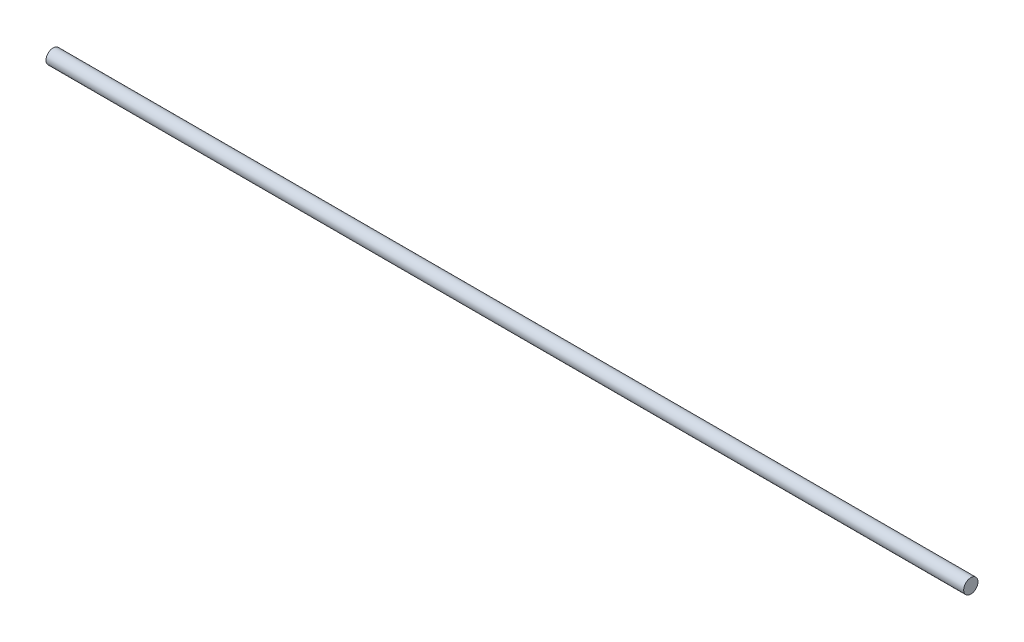
ISO-10303-21;
HEADER;
FILE_DESCRIPTION(('STEP AP214'),'2;1');
FILE_NAME('part.step','',(''),(''),'','','');
FILE_SCHEMA(('AUTOMOTIVE_DESIGN { 1 0 10303 214 1 1 1 1 }'));
ENDSEC;
DATA;
#1=APPLICATION_CONTEXT('core data for automotive mechanical design processes');
#2=APPLICATION_PROTOCOL_DEFINITION('international standard','automotive_design',2000,#1);
#3=PRODUCT_CONTEXT('',#1,'mechanical');
#4=PRODUCT('Part','Part','',(#3));
#5=PRODUCT_RELATED_PRODUCT_CATEGORY('part','',(#4));
#6=PRODUCT_DEFINITION_FORMATION('','',#4);
#7=PRODUCT_DEFINITION_CONTEXT('part definition',#1,'design');
#8=PRODUCT_DEFINITION('design','',#6,#7);
#9=PRODUCT_DEFINITION_SHAPE('','',#8);
#10=(LENGTH_UNIT() NAMED_UNIT(*) SI_UNIT(.MILLI.,.METRE.));
#11=(NAMED_UNIT(*) PLANE_ANGLE_UNIT() SI_UNIT($,.RADIAN.));
#12=(NAMED_UNIT(*) SI_UNIT($,.STERADIAN.) SOLID_ANGLE_UNIT());
#13=UNCERTAINTY_MEASURE_WITH_UNIT(LENGTH_MEASURE(1.E-05),#10,'distance_accuracy_value','');
#14=(GEOMETRIC_REPRESENTATION_CONTEXT(3) GLOBAL_UNCERTAINTY_ASSIGNED_CONTEXT((#13)) GLOBAL_UNIT_ASSIGNED_CONTEXT((#10,
#11,#12)) REPRESENTATION_CONTEXT('',''));
#15=CARTESIAN_POINT('',(0.,0.,0.));
#16=DIRECTION('',(0.,0.,1.));
#17=DIRECTION('',(1.,0.,0.));
#18=AXIS2_PLACEMENT_3D('',#15,#16,#17);
#19=CARTESIAN_POINT('',(508.,0.,0.));
#20=DIRECTION('',(-1.,0.,0.));
#21=DIRECTION('',(0.,0.,1.));
#22=AXIS2_PLACEMENT_3D('',#19,#20,#21);
#23=CYLINDRICAL_SURFACE('',#22,3.96875);
#24=CARTESIAN_POINT('',(508.,0.,0.));
#25=DIRECTION('',(1.,0.,0.));
#26=DIRECTION('',(0.,0.,-1.));
#27=AXIS2_PLACEMENT_3D('',#24,#25,#26);
#28=CIRCLE('',#27,3.96875);
#29=CARTESIAN_POINT('',(508.,0.,-3.96875));
#30=VERTEX_POINT('',#29);
#31=EDGE_CURVE('E10',#30,#30,#28,.T.);
#32=ORIENTED_EDGE('',*,*,#31,.F.);
#33=EDGE_LOOP('',(#32));
#34=FACE_BOUND('',#33,.T.);
#35=CARTESIAN_POINT('',(0.,0.,0.));
#36=DIRECTION('',(1.,0.,0.));
#37=DIRECTION('',(0.,0.,-1.));
#38=AXIS2_PLACEMENT_3D('',#35,#36,#37);
#39=CIRCLE('',#38,3.96875);
#40=CARTESIAN_POINT('',(0.,0.,-3.96875));
#41=VERTEX_POINT('',#40);
#42=EDGE_CURVE('E34',#41,#41,#39,.T.);
#43=ORIENTED_EDGE('',*,*,#42,.T.);
#44=EDGE_LOOP('',(#43));
#45=FACE_BOUND('',#44,.T.);
#46=ADVANCED_FACE('F31',(#34,#45),#23,.T.);
#47=CARTESIAN_POINT('',(508.,0.,0.));
#48=DIRECTION('',(1.,0.,0.));
#49=DIRECTION('',(0.,0.,-1.));
#50=AXIS2_PLACEMENT_3D('',#47,#48,#49);
#51=PLANE('',#50);
#52=ORIENTED_EDGE('',*,*,#31,.T.);
#53=EDGE_LOOP('',(#52));
#54=FACE_BOUND('',#53,.T.);
#55=ADVANCED_FACE('F46',(#54),#51,.T.);
#56=CARTESIAN_POINT('',(0.,0.,0.));
#57=DIRECTION('',(1.,0.,0.));
#58=DIRECTION('',(0.,0.,-1.));
#59=AXIS2_PLACEMENT_3D('',#56,#57,#58);
#60=PLANE('',#59);
#61=ORIENTED_EDGE('',*,*,#42,.F.);
#62=EDGE_LOOP('',(#61));
#63=FACE_BOUND('',#62,.T.);
#64=ADVANCED_FACE('F44',(#63),#60,.F.);
#65=CLOSED_SHELL('',(#46,#55,#64));
#66=MANIFOLD_SOLID_BREP('B2',#65);
#67=ADVANCED_BREP_SHAPE_REPRESENTATION('',(#18,#66),#14);
#68=SHAPE_DEFINITION_REPRESENTATION(#9,#67);
ENDSEC;
END-ISO-10303-21;
